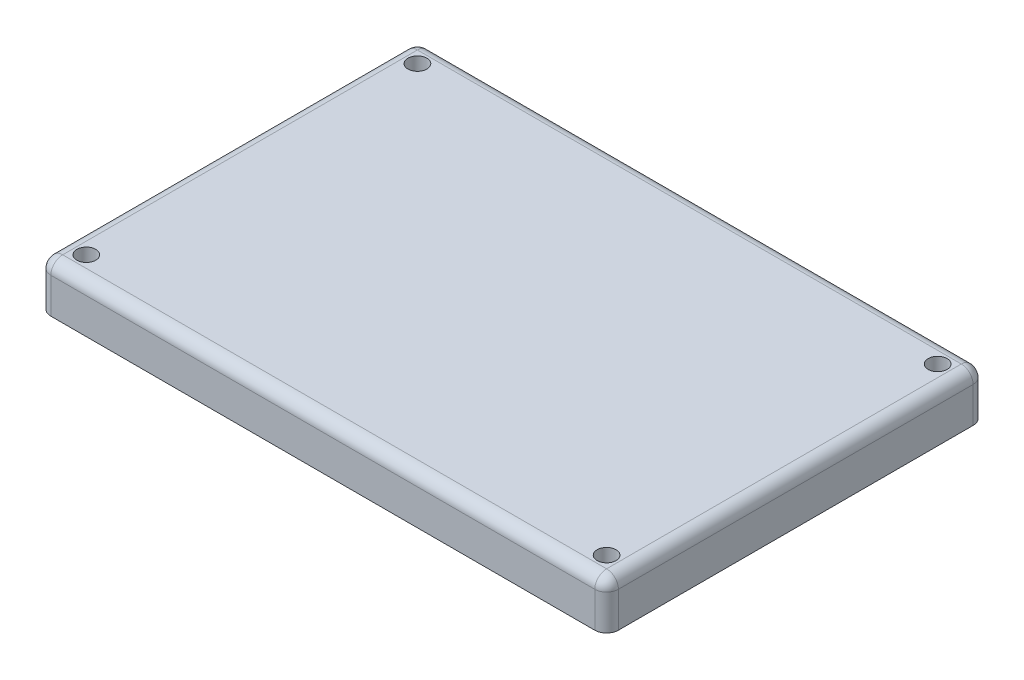
ISO-10303-21;
HEADER;
FILE_DESCRIPTION(('STEP AP214'),'2;1');
FILE_NAME('part.step','',(''),(''),'','','');
FILE_SCHEMA(('AUTOMOTIVE_DESIGN { 1 0 10303 214 1 1 1 1 }'));
ENDSEC;
DATA;
#1=APPLICATION_CONTEXT('core data for automotive mechanical design processes');
#2=APPLICATION_PROTOCOL_DEFINITION('international standard','automotive_design',2000,#1);
#3=PRODUCT_CONTEXT('',#1,'mechanical');
#4=PRODUCT('Part','Part','',(#3));
#5=PRODUCT_RELATED_PRODUCT_CATEGORY('part','',(#4));
#6=PRODUCT_DEFINITION_FORMATION('','',#4);
#7=PRODUCT_DEFINITION_CONTEXT('part definition',#1,'design');
#8=PRODUCT_DEFINITION('design','',#6,#7);
#9=PRODUCT_DEFINITION_SHAPE('','',#8);
#10=(LENGTH_UNIT() NAMED_UNIT(*) SI_UNIT(.MILLI.,.METRE.));
#11=(NAMED_UNIT(*) PLANE_ANGLE_UNIT() SI_UNIT($,.RADIAN.));
#12=(NAMED_UNIT(*) SI_UNIT($,.STERADIAN.) SOLID_ANGLE_UNIT());
#13=UNCERTAINTY_MEASURE_WITH_UNIT(LENGTH_MEASURE(1.E-05),#10,'distance_accuracy_value','');
#14=(GEOMETRIC_REPRESENTATION_CONTEXT(3) GLOBAL_UNCERTAINTY_ASSIGNED_CONTEXT((#13)) GLOBAL_UNIT_ASSIGNED_CONTEXT((#10,
#11,#12)) REPRESENTATION_CONTEXT('',''));
#15=CARTESIAN_POINT('',(0.,0.,0.));
#16=DIRECTION('',(0.,0.,1.));
#17=DIRECTION('',(1.,0.,0.));
#18=AXIS2_PLACEMENT_3D('',#15,#16,#17);
#19=CARTESIAN_POINT('',(0.,5.08,-40.64));
#20=DIRECTION('',(1.,0.,0.));
#21=DIRECTION('',(0.,0.,-1.));
#22=AXIS2_PLACEMENT_3D('',#19,#20,#21);
#23=PLANE('',#22);
#24=DIRECTION('',(0.,0.,1.));
#25=VECTOR('',#24,1.);
#26=CARTESIAN_POINT('',(0.,0.,-40.64));
#27=LINE('',#26,#25);
#28=CARTESIAN_POINT('',(0.,0.,-39.37));
#29=VERTEX_POINT('',#28);
#30=CARTESIAN_POINT('',(0.,0.,-1.27));
#31=VERTEX_POINT('',#30);
#32=EDGE_CURVE('E194',#29,#31,#27,.T.);
#33=ORIENTED_EDGE('',*,*,#32,.T.);
#34=DIRECTION('',(0.,-1.,0.));
#35=VECTOR('',#34,1.);
#36=CARTESIAN_POINT('',(0.,5.08,-1.27));
#37=LINE('',#36,#35);
#38=CARTESIAN_POINT('',(0.,3.81,-1.27));
#39=VERTEX_POINT('',#38);
#40=EDGE_CURVE('E11',#31,#39,#37,.F.);
#41=ORIENTED_EDGE('',*,*,#40,.T.);
#42=DIRECTION('',(0.,0.,1.));
#43=VECTOR('',#42,1.);
#44=CARTESIAN_POINT('',(0.,3.81,-40.64));
#45=LINE('',#44,#43);
#46=CARTESIAN_POINT('',(0.,3.81,-39.37));
#47=VERTEX_POINT('',#46);
#48=EDGE_CURVE('E48',#39,#47,#45,.F.);
#49=ORIENTED_EDGE('',*,*,#48,.T.);
#50=DIRECTION('',(0.,-1.,0.));
#51=VECTOR('',#50,1.);
#52=CARTESIAN_POINT('',(0.,5.08,-39.37));
#53=LINE('',#52,#51);
#54=EDGE_CURVE('E41',#47,#29,#53,.T.);
#55=ORIENTED_EDGE('',*,*,#54,.T.);
#56=EDGE_LOOP('',(#33,#41,#49,#55));
#57=FACE_BOUND('',#56,.T.);
#58=ADVANCED_FACE('F32',(#57),#23,.F.);
#59=CARTESIAN_POINT('',(0.,5.08,0.));
#60=DIRECTION('',(0.,0.,-1.));
#61=DIRECTION('',(-1.,0.,0.));
#62=AXIS2_PLACEMENT_3D('',#59,#60,#61);
#63=PLANE('',#62);
#64=DIRECTION('',(1.,0.,0.));
#65=VECTOR('',#64,1.);
#66=CARTESIAN_POINT('',(0.,0.,0.));
#67=LINE('',#66,#65);
#68=CARTESIAN_POINT('',(1.27,0.,0.));
#69=VERTEX_POINT('',#68);
#70=CARTESIAN_POINT('',(59.69,0.,0.));
#71=VERTEX_POINT('',#70);
#72=EDGE_CURVE('E196',#69,#71,#67,.T.);
#73=ORIENTED_EDGE('',*,*,#72,.T.);
#74=DIRECTION('',(0.,-1.,0.));
#75=VECTOR('',#74,1.);
#76=CARTESIAN_POINT('',(59.69,5.08,0.));
#77=LINE('',#76,#75);
#78=CARTESIAN_POINT('',(59.69,3.81,0.));
#79=VERTEX_POINT('',#78);
#80=EDGE_CURVE('E250',#71,#79,#77,.F.);
#81=ORIENTED_EDGE('',*,*,#80,.T.);
#82=DIRECTION('',(1.,0.,0.));
#83=VECTOR('',#82,1.);
#84=CARTESIAN_POINT('',(0.,3.81,0.));
#85=LINE('',#84,#83);
#86=CARTESIAN_POINT('',(1.27,3.81,0.));
#87=VERTEX_POINT('',#86);
#88=EDGE_CURVE('E248',#79,#87,#85,.F.);
#89=ORIENTED_EDGE('',*,*,#88,.T.);
#90=DIRECTION('',(0.,-1.,0.));
#91=VECTOR('',#90,1.);
#92=CARTESIAN_POINT('',(1.27,5.08,0.));
#93=LINE('',#92,#91);
#94=EDGE_CURVE('E246',#87,#69,#93,.T.);
#95=ORIENTED_EDGE('',*,*,#94,.T.);
#96=EDGE_LOOP('',(#73,#81,#89,#95));
#97=FACE_BOUND('',#96,.T.);
#98=ADVANCED_FACE('F377',(#97),#63,.F.);
#99=CARTESIAN_POINT('',(60.96,5.08,0.));
#100=DIRECTION('',(-1.,0.,0.));
#101=DIRECTION('',(0.,0.,1.));
#102=AXIS2_PLACEMENT_3D('',#99,#100,#101);
#103=PLANE('',#102);
#104=DIRECTION('',(0.,0.,-1.));
#105=VECTOR('',#104,1.);
#106=CARTESIAN_POINT('',(60.96,0.,0.));
#107=LINE('',#106,#105);
#108=CARTESIAN_POINT('',(60.96,0.,-1.27));
#109=VERTEX_POINT('',#108);
#110=CARTESIAN_POINT('',(60.96,0.,-39.37));
#111=VERTEX_POINT('',#110);
#112=EDGE_CURVE('E199',#109,#111,#107,.T.);
#113=ORIENTED_EDGE('',*,*,#112,.T.);
#114=DIRECTION('',(0.,-1.,0.));
#115=VECTOR('',#114,1.);
#116=CARTESIAN_POINT('',(60.96,5.08,-39.37));
#117=LINE('',#116,#115);
#118=CARTESIAN_POINT('',(60.96,3.81,-39.37));
#119=VERTEX_POINT('',#118);
#120=EDGE_CURVE('E235',#111,#119,#117,.F.);
#121=ORIENTED_EDGE('',*,*,#120,.T.);
#122=DIRECTION('',(0.,0.,-1.));
#123=VECTOR('',#122,1.);
#124=CARTESIAN_POINT('',(60.96,3.81,0.));
#125=LINE('',#124,#123);
#126=CARTESIAN_POINT('',(60.96,3.81,-1.27));
#127=VERTEX_POINT('',#126);
#128=EDGE_CURVE('E233',#119,#127,#125,.F.);
#129=ORIENTED_EDGE('',*,*,#128,.T.);
#130=DIRECTION('',(0.,-1.,0.));
#131=VECTOR('',#130,1.);
#132=CARTESIAN_POINT('',(60.96,5.08,-1.27));
#133=LINE('',#132,#131);
#134=EDGE_CURVE('E231',#127,#109,#133,.T.);
#135=ORIENTED_EDGE('',*,*,#134,.T.);
#136=EDGE_LOOP('',(#113,#121,#129,#135));
#137=FACE_BOUND('',#136,.T.);
#138=ADVANCED_FACE('F382',(#137),#103,.F.);
#139=CARTESIAN_POINT('',(60.96,5.08,-40.64));
#140=DIRECTION('',(0.,0.,1.));
#141=DIRECTION('',(1.,0.,0.));
#142=AXIS2_PLACEMENT_3D('',#139,#140,#141);
#143=PLANE('',#142);
#144=DIRECTION('',(-1.,0.,0.));
#145=VECTOR('',#144,1.);
#146=CARTESIAN_POINT('',(60.96,3.81,-40.64));
#147=LINE('',#146,#145);
#148=CARTESIAN_POINT('',(1.27,3.81,-40.64));
#149=VERTEX_POINT('',#148);
#150=CARTESIAN_POINT('',(59.69,3.81,-40.64));
#151=VERTEX_POINT('',#150);
#152=EDGE_CURVE('E216',#149,#151,#147,.F.);
#153=ORIENTED_EDGE('',*,*,#152,.T.);
#154=DIRECTION('',(0.,-1.,0.));
#155=VECTOR('',#154,1.);
#156=CARTESIAN_POINT('',(59.69,5.08,-40.64));
#157=LINE('',#156,#155);
#158=CARTESIAN_POINT('',(59.69,0.,-40.64));
#159=VERTEX_POINT('',#158);
#160=EDGE_CURVE('E220',#151,#159,#157,.T.);
#161=ORIENTED_EDGE('',*,*,#160,.T.);
#162=DIRECTION('',(-1.,0.,0.));
#163=VECTOR('',#162,1.);
#164=CARTESIAN_POINT('',(60.96,0.,-40.64));
#165=LINE('',#164,#163);
#166=CARTESIAN_POINT('',(1.26999999999999,0.,-40.64));
#167=VERTEX_POINT('',#166);
#168=EDGE_CURVE('E202',#159,#167,#165,.T.);
#169=ORIENTED_EDGE('',*,*,#168,.T.);
#170=DIRECTION('',(0.,-1.,0.));
#171=VECTOR('',#170,1.);
#172=CARTESIAN_POINT('',(1.26999999999999,5.08,-40.64));
#173=LINE('',#172,#171);
#174=EDGE_CURVE('E218',#167,#149,#173,.F.);
#175=ORIENTED_EDGE('',*,*,#174,.T.);
#176=EDGE_LOOP('',(#153,#161,#169,#175));
#177=FACE_BOUND('',#176,.T.);
#178=ADVANCED_FACE('F461',(#177),#143,.F.);
#179=CARTESIAN_POINT('',(0.,5.08,0.));
#180=DIRECTION('',(0.,1.,0.));
#181=DIRECTION('',(0.,0.,1.));
#182=AXIS2_PLACEMENT_3D('',#179,#180,#181);
#183=PLANE('',#182);
#184=DIRECTION('',(1.,0.,0.));
#185=VECTOR('',#184,1.);
#186=CARTESIAN_POINT('',(60.96,5.08,-1.27));
#187=LINE('',#186,#185);
#188=CARTESIAN_POINT('',(1.27,5.08,-1.27));
#189=VERTEX_POINT('',#188);
#190=CARTESIAN_POINT('',(59.69,5.08,-1.27));
#191=VERTEX_POINT('',#190);
#192=EDGE_CURVE('E241',#189,#191,#187,.T.);
#193=ORIENTED_EDGE('',*,*,#192,.T.);
#194=DIRECTION('',(0.,0.,-1.));
#195=VECTOR('',#194,1.);
#196=CARTESIAN_POINT('',(59.69,5.08,-40.64));
#197=LINE('',#196,#195);
#198=CARTESIAN_POINT('',(59.69,5.08,-39.37));
#199=VERTEX_POINT('',#198);
#200=EDGE_CURVE('E243',#191,#199,#197,.T.);
#201=ORIENTED_EDGE('',*,*,#200,.T.);
#202=DIRECTION('',(-1.,0.,0.));
#203=VECTOR('',#202,1.);
#204=CARTESIAN_POINT('',(0.,5.08,-39.37));
#205=LINE('',#204,#203);
#206=CARTESIAN_POINT('',(1.27,5.08,-39.37));
#207=VERTEX_POINT('',#206);
#208=EDGE_CURVE('E239',#199,#207,#205,.T.);
#209=ORIENTED_EDGE('',*,*,#208,.T.);
#210=DIRECTION('',(0.,0.,1.));
#211=VECTOR('',#210,1.);
#212=CARTESIAN_POINT('',(1.27,5.08,0.));
#213=LINE('',#212,#211);
#214=EDGE_CURVE('E237',#207,#189,#213,.T.);
#215=ORIENTED_EDGE('',*,*,#214,.T.);
#216=EDGE_LOOP('',(#193,#201,#209,#215));
#217=FACE_BOUND('',#216,.T.);
#218=CARTESIAN_POINT('',(2.54,5.08,-38.1));
#219=DIRECTION('',(0.,-1.,0.));
#220=DIRECTION('',(0.,0.,-1.));
#221=AXIS2_PLACEMENT_3D('',#218,#219,#220);
#222=CIRCLE('',#221,1.016);
#223=CARTESIAN_POINT('',(2.54,5.08,-39.116));
#224=VERTEX_POINT('',#223);
#225=EDGE_CURVE('E293',#224,#224,#222,.T.);
#226=ORIENTED_EDGE('',*,*,#225,.T.);
#227=EDGE_LOOP('',(#226));
#228=FACE_BOUND('',#227,.T.);
#229=CARTESIAN_POINT('',(2.54,5.08,-2.54));
#230=DIRECTION('',(0.,-1.,0.));
#231=DIRECTION('',(0.,0.,-1.));
#232=AXIS2_PLACEMENT_3D('',#229,#230,#231);
#233=CIRCLE('',#232,1.016);
#234=CARTESIAN_POINT('',(2.54,5.08,-3.556));
#235=VERTEX_POINT('',#234);
#236=EDGE_CURVE('E301',#235,#235,#233,.T.);
#237=ORIENTED_EDGE('',*,*,#236,.T.);
#238=EDGE_LOOP('',(#237));
#239=FACE_BOUND('',#238,.T.);
#240=CARTESIAN_POINT('',(58.42,5.08,-2.54));
#241=DIRECTION('',(0.,-1.,0.));
#242=DIRECTION('',(0.,0.,-1.));
#243=AXIS2_PLACEMENT_3D('',#240,#241,#242);
#244=CIRCLE('',#243,1.016);
#245=CARTESIAN_POINT('',(58.42,5.08,-3.556));
#246=VERTEX_POINT('',#245);
#247=EDGE_CURVE('E307',#246,#246,#244,.T.);
#248=ORIENTED_EDGE('',*,*,#247,.T.);
#249=EDGE_LOOP('',(#248));
#250=FACE_BOUND('',#249,.T.);
#251=CARTESIAN_POINT('',(58.42,5.08,-38.1));
#252=DIRECTION('',(0.,-1.,0.));
#253=DIRECTION('',(0.,0.,-1.));
#254=AXIS2_PLACEMENT_3D('',#251,#252,#253);
#255=CIRCLE('',#254,1.016);
#256=CARTESIAN_POINT('',(58.42,5.08,-39.116));
#257=VERTEX_POINT('',#256);
#258=EDGE_CURVE('E166',#257,#257,#255,.T.);
#259=ORIENTED_EDGE('',*,*,#258,.T.);
#260=EDGE_LOOP('',(#259));
#261=FACE_BOUND('',#260,.T.);
#262=ADVANCED_FACE('F456',(#217,#228,#239,#250,#261),#183,.T.);
#263=CARTESIAN_POINT('',(0.,0.,0.));
#264=DIRECTION('',(0.,1.,0.));
#265=DIRECTION('',(0.,0.,1.));
#266=AXIS2_PLACEMENT_3D('',#263,#264,#265);
#267=PLANE('',#266);
#268=CARTESIAN_POINT('',(2.54,0.,-38.1));
#269=DIRECTION('',(0.,-1.,0.));
#270=DIRECTION('',(0.,0.,-1.));
#271=AXIS2_PLACEMENT_3D('',#268,#269,#270);
#272=CIRCLE('',#271,1.016);
#273=CARTESIAN_POINT('',(2.54,0.,-39.116));
#274=VERTEX_POINT('',#273);
#275=EDGE_CURVE('E289',#274,#274,#272,.T.);
#276=ORIENTED_EDGE('',*,*,#275,.F.);
#277=EDGE_LOOP('',(#276));
#278=FACE_BOUND('',#277,.T.);
#279=CARTESIAN_POINT('',(2.54,0.,-2.54));
#280=DIRECTION('',(0.,-1.,0.));
#281=DIRECTION('',(0.,0.,-1.));
#282=AXIS2_PLACEMENT_3D('',#279,#280,#281);
#283=CIRCLE('',#282,1.016);
#284=CARTESIAN_POINT('',(2.54,0.,-3.556));
#285=VERTEX_POINT('',#284);
#286=EDGE_CURVE('E298',#285,#285,#283,.T.);
#287=ORIENTED_EDGE('',*,*,#286,.F.);
#288=EDGE_LOOP('',(#287));
#289=FACE_BOUND('',#288,.T.);
#290=CARTESIAN_POINT('',(58.42,0.,-2.54));
#291=DIRECTION('',(0.,-1.,0.));
#292=DIRECTION('',(0.,0.,-1.));
#293=AXIS2_PLACEMENT_3D('',#290,#291,#292);
#294=CIRCLE('',#293,1.016);
#295=CARTESIAN_POINT('',(58.42,0.,-3.556));
#296=VERTEX_POINT('',#295);
#297=EDGE_CURVE('E304',#296,#296,#294,.T.);
#298=ORIENTED_EDGE('',*,*,#297,.F.);
#299=EDGE_LOOP('',(#298));
#300=FACE_BOUND('',#299,.T.);
#301=CARTESIAN_POINT('',(58.42,0.,-38.1));
#302=DIRECTION('',(0.,-1.,0.));
#303=DIRECTION('',(0.,0.,-1.));
#304=AXIS2_PLACEMENT_3D('',#301,#302,#303);
#305=CIRCLE('',#304,1.016);
#306=CARTESIAN_POINT('',(58.42,0.,-39.116));
#307=VERTEX_POINT('',#306);
#308=EDGE_CURVE('E310',#307,#307,#305,.T.);
#309=ORIENTED_EDGE('',*,*,#308,.F.);
#310=EDGE_LOOP('',(#309));
#311=FACE_BOUND('',#310,.T.);
#312=ORIENTED_EDGE('',*,*,#168,.F.);
#313=CARTESIAN_POINT('',(59.69,0.,-39.37));
#314=DIRECTION('',(0.,1.,0.));
#315=DIRECTION('',(0.,0.,1.));
#316=AXIS2_PLACEMENT_3D('',#313,#314,#315);
#317=CIRCLE('',#316,1.27);
#318=EDGE_CURVE('E229',#159,#111,#317,.F.);
#319=ORIENTED_EDGE('',*,*,#318,.T.);
#320=ORIENTED_EDGE('',*,*,#112,.F.);
#321=CARTESIAN_POINT('',(59.69,0.,-1.27));
#322=DIRECTION('',(0.,1.,0.));
#323=DIRECTION('',(0.,0.,1.));
#324=AXIS2_PLACEMENT_3D('',#321,#322,#323);
#325=CIRCLE('',#324,1.27);
#326=EDGE_CURVE('E227',#109,#71,#325,.F.);
#327=ORIENTED_EDGE('',*,*,#326,.T.);
#328=ORIENTED_EDGE('',*,*,#72,.F.);
#329=CARTESIAN_POINT('',(1.27,0.,-1.27));
#330=DIRECTION('',(0.,1.,0.));
#331=DIRECTION('',(0.,0.,1.));
#332=AXIS2_PLACEMENT_3D('',#329,#330,#331);
#333=CIRCLE('',#332,1.27);
#334=EDGE_CURVE('E225',#69,#31,#333,.F.);
#335=ORIENTED_EDGE('',*,*,#334,.T.);
#336=ORIENTED_EDGE('',*,*,#32,.F.);
#337=CARTESIAN_POINT('',(1.27,0.,-39.37));
#338=DIRECTION('',(0.,1.,0.));
#339=DIRECTION('',(0.,0.,1.));
#340=AXIS2_PLACEMENT_3D('',#337,#338,#339);
#341=CIRCLE('',#340,1.27);
#342=EDGE_CURVE('E223',#29,#167,#341,.F.);
#343=ORIENTED_EDGE('',*,*,#342,.T.);
#344=EDGE_LOOP('',(#312,#319,#320,#327,#328,#335,#336,#343));
#345=FACE_BOUND('',#344,.T.);
#346=DIRECTION('',(-1.,0.,0.));
#347=VECTOR('',#346,1.);
#348=CARTESIAN_POINT('',(60.96,0.,-38.1));
#349=LINE('',#348,#347);
#350=CARTESIAN_POINT('',(55.88,0.,-38.1));
#351=VERTEX_POINT('',#350);
#352=CARTESIAN_POINT('',(5.08,0.,-38.1));
#353=VERTEX_POINT('',#352);
#354=EDGE_CURVE('E173',#351,#353,#349,.T.);
#355=ORIENTED_EDGE('',*,*,#354,.T.);
#356=CARTESIAN_POINT('',(2.54,0.,-38.1));
#357=DIRECTION('',(0.,-1.,0.));
#358=DIRECTION('',(0.,0.,-1.));
#359=AXIS2_PLACEMENT_3D('',#356,#357,#358);
#360=CIRCLE('',#359,2.54);
#361=CARTESIAN_POINT('',(2.54,0.,-35.56));
#362=VERTEX_POINT('',#361);
#363=EDGE_CURVE('E156',#353,#362,#360,.T.);
#364=ORIENTED_EDGE('',*,*,#363,.T.);
#365=DIRECTION('',(0.,0.,1.));
#366=VECTOR('',#365,1.);
#367=CARTESIAN_POINT('',(2.54,0.,-40.64));
#368=LINE('',#367,#366);
#369=CARTESIAN_POINT('',(2.54,0.,-5.08));
#370=VERTEX_POINT('',#369);
#371=EDGE_CURVE('E189',#362,#370,#368,.T.);
#372=ORIENTED_EDGE('',*,*,#371,.T.);
#373=CARTESIAN_POINT('',(2.54,0.,-2.54));
#374=DIRECTION('',(0.,-1.,0.));
#375=DIRECTION('',(0.,0.,-1.));
#376=AXIS2_PLACEMENT_3D('',#373,#374,#375);
#377=CIRCLE('',#376,2.54);
#378=CARTESIAN_POINT('',(5.08,0.,-2.54));
#379=VERTEX_POINT('',#378);
#380=EDGE_CURVE('E325',#370,#379,#377,.T.);
#381=ORIENTED_EDGE('',*,*,#380,.T.);
#382=DIRECTION('',(1.,0.,0.));
#383=VECTOR('',#382,1.);
#384=CARTESIAN_POINT('',(0.,0.,-2.54));
#385=LINE('',#384,#383);
#386=CARTESIAN_POINT('',(55.88,0.,-2.54));
#387=VERTEX_POINT('',#386);
#388=EDGE_CURVE('E186',#379,#387,#385,.T.);
#389=ORIENTED_EDGE('',*,*,#388,.T.);
#390=CARTESIAN_POINT('',(58.42,0.,-2.54));
#391=DIRECTION('',(0.,-1.,0.));
#392=DIRECTION('',(0.,0.,-1.));
#393=AXIS2_PLACEMENT_3D('',#390,#391,#392);
#394=CIRCLE('',#393,2.54);
#395=CARTESIAN_POINT('',(58.42,0.,-5.08));
#396=VERTEX_POINT('',#395);
#397=EDGE_CURVE('E318',#387,#396,#394,.T.);
#398=ORIENTED_EDGE('',*,*,#397,.T.);
#399=DIRECTION('',(0.,0.,-1.));
#400=VECTOR('',#399,1.);
#401=CARTESIAN_POINT('',(58.42,0.,0.));
#402=LINE('',#401,#400);
#403=CARTESIAN_POINT('',(58.42,0.,-35.56));
#404=VERTEX_POINT('',#403);
#405=EDGE_CURVE('E182',#396,#404,#402,.T.);
#406=ORIENTED_EDGE('',*,*,#405,.T.);
#407=CARTESIAN_POINT('',(58.42,0.,-38.1));
#408=DIRECTION('',(0.,-1.,0.));
#409=DIRECTION('',(0.,0.,-1.));
#410=AXIS2_PLACEMENT_3D('',#407,#408,#409);
#411=CIRCLE('',#410,2.54);
#412=EDGE_CURVE('E180',#404,#351,#411,.T.);
#413=ORIENTED_EDGE('',*,*,#412,.T.);
#414=EDGE_LOOP('',(#355,#364,#372,#381,#389,#398,#406,#413));
#415=FACE_BOUND('',#414,.T.);
#416=ADVANCED_FACE('F178',(#278,#289,#300,#311,#345,#415),#267,.F.);
#417=CARTESIAN_POINT('',(2.54,5.08,-40.64));
#418=DIRECTION('',(1.,0.,0.));
#419=DIRECTION('',(0.,0.,-1.));
#420=AXIS2_PLACEMENT_3D('',#417,#418,#419);
#421=PLANE('',#420);
#422=DIRECTION('',(0.,-1.,0.));
#423=VECTOR('',#422,1.);
#424=CARTESIAN_POINT('',(2.54,5.08,-35.56));
#425=LINE('',#424,#423);
#426=CARTESIAN_POINT('',(2.54,2.54,-35.56));
#427=VERTEX_POINT('',#426);
#428=EDGE_CURVE('E162',#427,#362,#425,.T.);
#429=ORIENTED_EDGE('',*,*,#428,.F.);
#430=DIRECTION('',(0.,0.,1.));
#431=VECTOR('',#430,1.);
#432=CARTESIAN_POINT('',(2.54,2.54,-40.64));
#433=LINE('',#432,#431);
#434=CARTESIAN_POINT('',(2.54,2.54,-5.08));
#435=VERTEX_POINT('',#434);
#436=EDGE_CURVE('E181',#427,#435,#433,.T.);
#437=ORIENTED_EDGE('',*,*,#436,.T.);
#438=DIRECTION('',(0.,-1.,0.));
#439=VECTOR('',#438,1.);
#440=CARTESIAN_POINT('',(2.54,5.08,-5.08));
#441=LINE('',#440,#439);
#442=EDGE_CURVE('E330',#370,#435,#441,.F.);
#443=ORIENTED_EDGE('',*,*,#442,.F.);
#444=ORIENTED_EDGE('',*,*,#371,.F.);
#445=EDGE_LOOP('',(#429,#437,#443,#444));
#446=FACE_BOUND('',#445,.T.);
#447=ADVANCED_FACE('F354',(#446),#421,.T.);
#448=CARTESIAN_POINT('',(0.,5.08,-2.54));
#449=DIRECTION('',(0.,0.,-1.));
#450=DIRECTION('',(-1.,0.,0.));
#451=AXIS2_PLACEMENT_3D('',#448,#449,#450);
#452=PLANE('',#451);
#453=DIRECTION('',(0.,-1.,0.));
#454=VECTOR('',#453,1.);
#455=CARTESIAN_POINT('',(55.88,5.08,-2.54));
#456=LINE('',#455,#454);
#457=CARTESIAN_POINT('',(55.88,2.54,-2.54));
#458=VERTEX_POINT('',#457);
#459=EDGE_CURVE('E323',#387,#458,#456,.F.);
#460=ORIENTED_EDGE('',*,*,#459,.F.);
#461=ORIENTED_EDGE('',*,*,#388,.F.);
#462=DIRECTION('',(0.,-1.,0.));
#463=VECTOR('',#462,1.);
#464=CARTESIAN_POINT('',(5.08,5.08,-2.54));
#465=LINE('',#464,#463);
#466=CARTESIAN_POINT('',(5.08,2.54,-2.54));
#467=VERTEX_POINT('',#466);
#468=EDGE_CURVE('E328',#467,#379,#465,.T.);
#469=ORIENTED_EDGE('',*,*,#468,.F.);
#470=DIRECTION('',(1.,0.,0.));
#471=VECTOR('',#470,1.);
#472=CARTESIAN_POINT('',(0.,2.54,-2.54));
#473=LINE('',#472,#471);
#474=EDGE_CURVE('E184',#467,#458,#473,.T.);
#475=ORIENTED_EDGE('',*,*,#474,.T.);
#476=EDGE_LOOP('',(#460,#461,#469,#475));
#477=FACE_BOUND('',#476,.T.);
#478=ADVANCED_FACE('F364',(#477),#452,.T.);
#479=CARTESIAN_POINT('',(58.42,5.08,0.));
#480=DIRECTION('',(-1.,0.,0.));
#481=DIRECTION('',(0.,0.,1.));
#482=AXIS2_PLACEMENT_3D('',#479,#480,#481);
#483=PLANE('',#482);
#484=DIRECTION('',(0.,-1.,0.));
#485=VECTOR('',#484,1.);
#486=CARTESIAN_POINT('',(58.42,5.08,-5.08));
#487=LINE('',#486,#485);
#488=CARTESIAN_POINT('',(58.42,2.54,-5.08));
#489=VERTEX_POINT('',#488);
#490=EDGE_CURVE('E321',#489,#396,#487,.T.);
#491=ORIENTED_EDGE('',*,*,#490,.F.);
#492=DIRECTION('',(0.,0.,-1.));
#493=VECTOR('',#492,1.);
#494=CARTESIAN_POINT('',(58.42,2.54,0.));
#495=LINE('',#494,#493);
#496=CARTESIAN_POINT('',(58.42,2.54,-35.56));
#497=VERTEX_POINT('',#496);
#498=EDGE_CURVE('E341',#489,#497,#495,.T.);
#499=ORIENTED_EDGE('',*,*,#498,.T.);
#500=DIRECTION('',(0.,-1.,0.));
#501=VECTOR('',#500,1.);
#502=CARTESIAN_POINT('',(58.42,5.08,-35.56));
#503=LINE('',#502,#501);
#504=EDGE_CURVE('E336',#404,#497,#503,.F.);
#505=ORIENTED_EDGE('',*,*,#504,.F.);
#506=ORIENTED_EDGE('',*,*,#405,.F.);
#507=EDGE_LOOP('',(#491,#499,#505,#506));
#508=FACE_BOUND('',#507,.T.);
#509=ADVANCED_FACE('F346',(#508),#483,.T.);
#510=CARTESIAN_POINT('',(60.96,5.08,-38.1));
#511=DIRECTION('',(0.,0.,1.));
#512=DIRECTION('',(1.,0.,0.));
#513=AXIS2_PLACEMENT_3D('',#510,#511,#512);
#514=PLANE('',#513);
#515=DIRECTION('',(0.,-1.,0.));
#516=VECTOR('',#515,1.);
#517=CARTESIAN_POINT('',(5.08,5.08,-38.1));
#518=LINE('',#517,#516);
#519=CARTESIAN_POINT('',(5.08,2.54,-38.1));
#520=VERTEX_POINT('',#519);
#521=EDGE_CURVE('E159',#353,#520,#518,.F.);
#522=ORIENTED_EDGE('',*,*,#521,.F.);
#523=ORIENTED_EDGE('',*,*,#354,.F.);
#524=DIRECTION('',(0.,-1.,0.));
#525=VECTOR('',#524,1.);
#526=CARTESIAN_POINT('',(55.88,5.08,-38.1));
#527=LINE('',#526,#525);
#528=CARTESIAN_POINT('',(55.88,2.54,-38.1));
#529=VERTEX_POINT('',#528);
#530=EDGE_CURVE('E334',#529,#351,#527,.T.);
#531=ORIENTED_EDGE('',*,*,#530,.F.);
#532=DIRECTION('',(-1.,0.,0.));
#533=VECTOR('',#532,1.);
#534=CARTESIAN_POINT('',(60.96,2.54,-38.1));
#535=LINE('',#534,#533);
#536=EDGE_CURVE('E175',#529,#520,#535,.T.);
#537=ORIENTED_EDGE('',*,*,#536,.T.);
#538=EDGE_LOOP('',(#522,#523,#531,#537));
#539=FACE_BOUND('',#538,.T.);
#540=ADVANCED_FACE('F171',(#539),#514,.T.);
#541=CARTESIAN_POINT('',(0.,2.54,0.));
#542=DIRECTION('',(0.,1.,0.));
#543=DIRECTION('',(0.,0.,1.));
#544=AXIS2_PLACEMENT_3D('',#541,#542,#543);
#545=PLANE('',#544);
#546=ORIENTED_EDGE('',*,*,#436,.F.);
#547=CARTESIAN_POINT('',(2.54,2.54,-38.1));
#548=DIRECTION('',(0.,1.,0.));
#549=DIRECTION('',(0.,0.,1.));
#550=AXIS2_PLACEMENT_3D('',#547,#548,#549);
#551=CIRCLE('',#550,2.54);
#552=EDGE_CURVE('E214',#427,#520,#551,.T.);
#553=ORIENTED_EDGE('',*,*,#552,.T.);
#554=ORIENTED_EDGE('',*,*,#536,.F.);
#555=CARTESIAN_POINT('',(58.42,2.54,-38.1));
#556=DIRECTION('',(0.,1.,0.));
#557=DIRECTION('',(0.,0.,1.));
#558=AXIS2_PLACEMENT_3D('',#555,#556,#557);
#559=CIRCLE('',#558,2.54);
#560=EDGE_CURVE('E205',#529,#497,#559,.T.);
#561=ORIENTED_EDGE('',*,*,#560,.T.);
#562=ORIENTED_EDGE('',*,*,#498,.F.);
#563=CARTESIAN_POINT('',(58.42,2.54,-2.54));
#564=DIRECTION('',(0.,1.,0.));
#565=DIRECTION('',(0.,0.,1.));
#566=AXIS2_PLACEMENT_3D('',#563,#564,#565);
#567=CIRCLE('',#566,2.54);
#568=EDGE_CURVE('E211',#489,#458,#567,.T.);
#569=ORIENTED_EDGE('',*,*,#568,.T.);
#570=ORIENTED_EDGE('',*,*,#474,.F.);
#571=CARTESIAN_POINT('',(2.54,2.54,-2.54));
#572=DIRECTION('',(0.,1.,0.));
#573=DIRECTION('',(0.,0.,1.));
#574=AXIS2_PLACEMENT_3D('',#571,#572,#573);
#575=CIRCLE('',#574,2.54);
#576=EDGE_CURVE('E208',#467,#435,#575,.T.);
#577=ORIENTED_EDGE('',*,*,#576,.T.);
#578=EDGE_LOOP('',(#546,#553,#554,#561,#562,#569,#570,#577));
#579=FACE_BOUND('',#578,.T.);
#580=ADVANCED_FACE('F352',(#579),#545,.F.);
#581=CARTESIAN_POINT('',(58.42,5.08,-38.1));
#582=DIRECTION('',(0.,-1.,0.));
#583=DIRECTION('',(0.,0.,-1.));
#584=AXIS2_PLACEMENT_3D('',#581,#582,#583);
#585=CYLINDRICAL_SURFACE('',#584,2.54);
#586=ORIENTED_EDGE('',*,*,#412,.F.);
#587=ORIENTED_EDGE('',*,*,#504,.T.);
#588=ORIENTED_EDGE('',*,*,#560,.F.);
#589=ORIENTED_EDGE('',*,*,#530,.T.);
#590=EDGE_LOOP('',(#586,#587,#588,#589));
#591=FACE_BOUND('',#590,.T.);
#592=ADVANCED_FACE('F350',(#591),#585,.T.);
#593=CARTESIAN_POINT('',(2.54,5.08,-2.54));
#594=DIRECTION('',(0.,-1.,0.));
#595=DIRECTION('',(0.,0.,-1.));
#596=AXIS2_PLACEMENT_3D('',#593,#594,#595);
#597=CYLINDRICAL_SURFACE('',#596,2.54);
#598=ORIENTED_EDGE('',*,*,#380,.F.);
#599=ORIENTED_EDGE('',*,*,#442,.T.);
#600=ORIENTED_EDGE('',*,*,#576,.F.);
#601=ORIENTED_EDGE('',*,*,#468,.T.);
#602=EDGE_LOOP('',(#598,#599,#600,#601));
#603=FACE_BOUND('',#602,.T.);
#604=ADVANCED_FACE('F359',(#603),#597,.T.);
#605=CARTESIAN_POINT('',(58.42,5.08,-2.54));
#606=DIRECTION('',(0.,-1.,0.));
#607=DIRECTION('',(0.,0.,-1.));
#608=AXIS2_PLACEMENT_3D('',#605,#606,#607);
#609=CYLINDRICAL_SURFACE('',#608,2.54);
#610=ORIENTED_EDGE('',*,*,#397,.F.);
#611=ORIENTED_EDGE('',*,*,#459,.T.);
#612=ORIENTED_EDGE('',*,*,#568,.F.);
#613=ORIENTED_EDGE('',*,*,#490,.T.);
#614=EDGE_LOOP('',(#610,#611,#612,#613));
#615=FACE_BOUND('',#614,.T.);
#616=ADVANCED_FACE('F366',(#615),#609,.T.);
#617=CARTESIAN_POINT('',(2.54,5.08,-38.1));
#618=DIRECTION('',(0.,-1.,0.));
#619=DIRECTION('',(0.,0.,-1.));
#620=AXIS2_PLACEMENT_3D('',#617,#618,#619);
#621=CYLINDRICAL_SURFACE('',#620,2.54);
#622=ORIENTED_EDGE('',*,*,#552,.F.);
#623=ORIENTED_EDGE('',*,*,#428,.T.);
#624=ORIENTED_EDGE('',*,*,#363,.F.);
#625=ORIENTED_EDGE('',*,*,#521,.T.);
#626=EDGE_LOOP('',(#622,#623,#624,#625));
#627=FACE_BOUND('',#626,.T.);
#628=ADVANCED_FACE('F158',(#627),#621,.T.);
#629=CARTESIAN_POINT('',(58.42,5.08,-38.1));
#630=DIRECTION('',(0.,-1.,0.));
#631=DIRECTION('',(0.,0.,-1.));
#632=AXIS2_PLACEMENT_3D('',#629,#630,#631);
#633=CYLINDRICAL_SURFACE('',#632,1.016);
#634=ORIENTED_EDGE('',*,*,#258,.F.);
#635=EDGE_LOOP('',(#634));
#636=FACE_BOUND('',#635,.T.);
#637=ORIENTED_EDGE('',*,*,#308,.T.);
#638=EDGE_LOOP('',(#637));
#639=FACE_BOUND('',#638,.T.);
#640=ADVANCED_FACE('F373',(#636,#639),#633,.F.);
#641=CARTESIAN_POINT('',(58.42,5.08,-2.54));
#642=DIRECTION('',(0.,-1.,0.));
#643=DIRECTION('',(0.,0.,-1.));
#644=AXIS2_PLACEMENT_3D('',#641,#642,#643);
#645=CYLINDRICAL_SURFACE('',#644,1.016);
#646=ORIENTED_EDGE('',*,*,#247,.F.);
#647=EDGE_LOOP('',(#646));
#648=FACE_BOUND('',#647,.T.);
#649=ORIENTED_EDGE('',*,*,#297,.T.);
#650=EDGE_LOOP('',(#649));
#651=FACE_BOUND('',#650,.T.);
#652=ADVANCED_FACE('F515',(#648,#651),#645,.F.);
#653=CARTESIAN_POINT('',(2.54,5.08,-2.54));
#654=DIRECTION('',(0.,-1.,0.));
#655=DIRECTION('',(0.,0.,-1.));
#656=AXIS2_PLACEMENT_3D('',#653,#654,#655);
#657=CYLINDRICAL_SURFACE('',#656,1.016);
#658=ORIENTED_EDGE('',*,*,#236,.F.);
#659=EDGE_LOOP('',(#658));
#660=FACE_BOUND('',#659,.T.);
#661=ORIENTED_EDGE('',*,*,#286,.T.);
#662=EDGE_LOOP('',(#661));
#663=FACE_BOUND('',#662,.T.);
#664=ADVANCED_FACE('F525',(#660,#663),#657,.F.);
#665=CARTESIAN_POINT('',(2.54,5.08,-38.1));
#666=DIRECTION('',(0.,-1.,0.));
#667=DIRECTION('',(0.,0.,-1.));
#668=AXIS2_PLACEMENT_3D('',#665,#666,#667);
#669=CYLINDRICAL_SURFACE('',#668,1.016);
#670=ORIENTED_EDGE('',*,*,#225,.F.);
#671=EDGE_LOOP('',(#670));
#672=FACE_BOUND('',#671,.T.);
#673=ORIENTED_EDGE('',*,*,#275,.T.);
#674=EDGE_LOOP('',(#673));
#675=FACE_BOUND('',#674,.T.);
#676=ADVANCED_FACE('F430',(#672,#675),#669,.F.);
#677=CARTESIAN_POINT('',(1.27,5.08,-1.27));
#678=DIRECTION('',(0.,-1.,0.));
#679=DIRECTION('',(0.,0.,-1.));
#680=AXIS2_PLACEMENT_3D('',#677,#678,#679);
#681=CYLINDRICAL_SURFACE('',#680,1.27);
#682=CARTESIAN_POINT('',(1.27,3.81,-1.27));
#683=DIRECTION('',(0.,1.,0.));
#684=DIRECTION('',(0.,0.,1.));
#685=AXIS2_PLACEMENT_3D('',#682,#683,#684);
#686=CIRCLE('',#685,1.27);
#687=EDGE_CURVE('E36',#39,#87,#686,.T.);
#688=ORIENTED_EDGE('',*,*,#687,.F.);
#689=ORIENTED_EDGE('',*,*,#40,.F.);
#690=ORIENTED_EDGE('',*,*,#334,.F.);
#691=ORIENTED_EDGE('',*,*,#94,.F.);
#692=EDGE_LOOP('',(#688,#689,#690,#691));
#693=FACE_BOUND('',#692,.T.);
#694=ADVANCED_FACE('F34',(#693),#681,.T.);
#695=CARTESIAN_POINT('',(1.27,3.81,-1.27));
#696=DIRECTION('',(0.,0.,1.));
#697=DIRECTION('',(1.,0.,0.));
#698=AXIS2_PLACEMENT_3D('',#695,#696,#697);
#699=SPHERICAL_SURFACE('',#698,1.27);
#700=CARTESIAN_POINT('',(1.27,3.81,-1.27));
#701=DIRECTION('',(0.,0.,1.));
#702=DIRECTION('',(1.,0.,0.));
#703=AXIS2_PLACEMENT_3D('',#700,#701,#702);
#704=CIRCLE('',#703,1.27);
#705=EDGE_CURVE('E280',#39,#189,#704,.F.);
#706=ORIENTED_EDGE('',*,*,#705,.F.);
#707=ORIENTED_EDGE('',*,*,#687,.T.);
#708=CARTESIAN_POINT('',(1.27,3.81,-1.27));
#709=DIRECTION('',(-1.,0.,0.));
#710=DIRECTION('',(0.,0.,1.));
#711=AXIS2_PLACEMENT_3D('',#708,#709,#710);
#712=CIRCLE('',#711,1.27);
#713=EDGE_CURVE('E282',#189,#87,#712,.F.);
#714=ORIENTED_EDGE('',*,*,#713,.F.);
#715=EDGE_LOOP('',(#706,#707,#714));
#716=FACE_BOUND('',#715,.T.);
#717=ADVANCED_FACE('F424',(#716),#699,.T.);
#718=CARTESIAN_POINT('',(59.69,5.08,-1.27));
#719=DIRECTION('',(0.,-1.,0.));
#720=DIRECTION('',(0.,0.,-1.));
#721=AXIS2_PLACEMENT_3D('',#718,#719,#720);
#722=CYLINDRICAL_SURFACE('',#721,1.27);
#723=ORIENTED_EDGE('',*,*,#326,.F.);
#724=ORIENTED_EDGE('',*,*,#134,.F.);
#725=CARTESIAN_POINT('',(59.69,3.81,-1.27));
#726=DIRECTION('',(0.,1.,0.));
#727=DIRECTION('',(0.,0.,1.));
#728=AXIS2_PLACEMENT_3D('',#725,#726,#727);
#729=CIRCLE('',#728,1.27);
#730=EDGE_CURVE('E277',#79,#127,#729,.T.);
#731=ORIENTED_EDGE('',*,*,#730,.F.);
#732=ORIENTED_EDGE('',*,*,#80,.F.);
#733=EDGE_LOOP('',(#723,#724,#731,#732));
#734=FACE_BOUND('',#733,.T.);
#735=ADVANCED_FACE('F422',(#734),#722,.T.);
#736=CARTESIAN_POINT('',(0.,3.81,-1.27));
#737=DIRECTION('',(-1.,0.,0.));
#738=DIRECTION('',(0.,0.,1.));
#739=AXIS2_PLACEMENT_3D('',#736,#737,#738);
#740=CYLINDRICAL_SURFACE('',#739,1.27);
#741=ORIENTED_EDGE('',*,*,#713,.T.);
#742=ORIENTED_EDGE('',*,*,#88,.F.);
#743=CARTESIAN_POINT('',(59.69,3.81,-1.27));
#744=DIRECTION('',(1.,0.,0.));
#745=DIRECTION('',(0.,0.,-1.));
#746=AXIS2_PLACEMENT_3D('',#743,#744,#745);
#747=CIRCLE('',#746,1.27);
#748=EDGE_CURVE('E274',#191,#79,#747,.T.);
#749=ORIENTED_EDGE('',*,*,#748,.F.);
#750=ORIENTED_EDGE('',*,*,#192,.F.);
#751=EDGE_LOOP('',(#741,#742,#749,#750));
#752=FACE_BOUND('',#751,.T.);
#753=ADVANCED_FACE('F418',(#752),#740,.T.);
#754=CARTESIAN_POINT('',(1.27,3.81,0.));
#755=DIRECTION('',(0.,0.,-1.));
#756=DIRECTION('',(-1.,0.,0.));
#757=AXIS2_PLACEMENT_3D('',#754,#755,#756);
#758=CYLINDRICAL_SURFACE('',#757,1.27);
#759=ORIENTED_EDGE('',*,*,#705,.T.);
#760=ORIENTED_EDGE('',*,*,#214,.F.);
#761=CARTESIAN_POINT('',(1.27,3.81,-39.37));
#762=DIRECTION('',(0.,0.,-1.));
#763=DIRECTION('',(-1.,0.,0.));
#764=AXIS2_PLACEMENT_3D('',#761,#762,#763);
#765=CIRCLE('',#764,1.27);
#766=EDGE_CURVE('E271',#47,#207,#765,.T.);
#767=ORIENTED_EDGE('',*,*,#766,.F.);
#768=ORIENTED_EDGE('',*,*,#48,.F.);
#769=EDGE_LOOP('',(#759,#760,#767,#768));
#770=FACE_BOUND('',#769,.T.);
#771=ADVANCED_FACE('F414',(#770),#758,.T.);
#772=CARTESIAN_POINT('',(1.27,5.08,-39.37));
#773=DIRECTION('',(0.,-1.,0.));
#774=DIRECTION('',(0.,0.,-1.));
#775=AXIS2_PLACEMENT_3D('',#772,#773,#774);
#776=CYLINDRICAL_SURFACE('',#775,1.27);
#777=ORIENTED_EDGE('',*,*,#342,.F.);
#778=ORIENTED_EDGE('',*,*,#54,.F.);
#779=CARTESIAN_POINT('',(1.27,3.81,-39.37));
#780=DIRECTION('',(0.,1.,0.));
#781=DIRECTION('',(0.,0.,1.));
#782=AXIS2_PLACEMENT_3D('',#779,#780,#781);
#783=CIRCLE('',#782,1.27);
#784=EDGE_CURVE('E268',#149,#47,#783,.T.);
#785=ORIENTED_EDGE('',*,*,#784,.F.);
#786=ORIENTED_EDGE('',*,*,#174,.F.);
#787=EDGE_LOOP('',(#777,#778,#785,#786));
#788=FACE_BOUND('',#787,.T.);
#789=ADVANCED_FACE('F410',(#788),#776,.T.);
#790=CARTESIAN_POINT('',(59.69,3.81,-1.27));
#791=DIRECTION('',(0.,0.,1.));
#792=DIRECTION('',(1.,0.,0.));
#793=AXIS2_PLACEMENT_3D('',#790,#791,#792);
#794=SPHERICAL_SURFACE('',#793,1.27);
#795=ORIENTED_EDGE('',*,*,#748,.T.);
#796=ORIENTED_EDGE('',*,*,#730,.T.);
#797=CARTESIAN_POINT('',(59.69,3.81,-1.27));
#798=DIRECTION('',(0.,0.,1.));
#799=DIRECTION('',(1.,0.,0.));
#800=AXIS2_PLACEMENT_3D('',#797,#798,#799);
#801=CIRCLE('',#800,1.27);
#802=EDGE_CURVE('E265',#191,#127,#801,.F.);
#803=ORIENTED_EDGE('',*,*,#802,.F.);
#804=EDGE_LOOP('',(#795,#796,#803));
#805=FACE_BOUND('',#804,.T.);
#806=ADVANCED_FACE('F406',(#805),#794,.T.);
#807=CARTESIAN_POINT('',(1.27,3.81,-39.37));
#808=DIRECTION('',(0.,0.,1.));
#809=DIRECTION('',(1.,0.,0.));
#810=AXIS2_PLACEMENT_3D('',#807,#808,#809);
#811=SPHERICAL_SURFACE('',#810,1.27);
#812=ORIENTED_EDGE('',*,*,#784,.T.);
#813=ORIENTED_EDGE('',*,*,#766,.T.);
#814=CARTESIAN_POINT('',(1.27,3.81,-39.37));
#815=DIRECTION('',(-1.,0.,0.));
#816=DIRECTION('',(0.,0.,1.));
#817=AXIS2_PLACEMENT_3D('',#814,#815,#816);
#818=CIRCLE('',#817,1.27);
#819=EDGE_CURVE('E262',#149,#207,#818,.F.);
#820=ORIENTED_EDGE('',*,*,#819,.F.);
#821=EDGE_LOOP('',(#812,#813,#820));
#822=FACE_BOUND('',#821,.T.);
#823=ADVANCED_FACE('F402',(#822),#811,.T.);
#824=CARTESIAN_POINT('',(59.69,3.81,0.));
#825=DIRECTION('',(0.,0.,1.));
#826=DIRECTION('',(1.,0.,0.));
#827=AXIS2_PLACEMENT_3D('',#824,#825,#826);
#828=CYLINDRICAL_SURFACE('',#827,1.27);
#829=ORIENTED_EDGE('',*,*,#802,.T.);
#830=ORIENTED_EDGE('',*,*,#128,.F.);
#831=CARTESIAN_POINT('',(59.69,3.81,-39.37));
#832=DIRECTION('',(0.,0.,-1.));
#833=DIRECTION('',(-1.,0.,0.));
#834=AXIS2_PLACEMENT_3D('',#831,#832,#833);
#835=CIRCLE('',#834,1.27);
#836=EDGE_CURVE('E259',#199,#119,#835,.T.);
#837=ORIENTED_EDGE('',*,*,#836,.F.);
#838=ORIENTED_EDGE('',*,*,#200,.F.);
#839=EDGE_LOOP('',(#829,#830,#837,#838));
#840=FACE_BOUND('',#839,.T.);
#841=ADVANCED_FACE('F398',(#840),#828,.T.);
#842=CARTESIAN_POINT('',(0.,3.81,-39.37));
#843=DIRECTION('',(1.,0.,0.));
#844=DIRECTION('',(0.,0.,-1.));
#845=AXIS2_PLACEMENT_3D('',#842,#843,#844);
#846=CYLINDRICAL_SURFACE('',#845,1.27);
#847=ORIENTED_EDGE('',*,*,#819,.T.);
#848=ORIENTED_EDGE('',*,*,#208,.F.);
#849=CARTESIAN_POINT('',(59.69,3.81,-39.37));
#850=DIRECTION('',(1.,0.,0.));
#851=DIRECTION('',(0.,0.,-1.));
#852=AXIS2_PLACEMENT_3D('',#849,#850,#851);
#853=CIRCLE('',#852,1.27);
#854=EDGE_CURVE('E257',#151,#199,#853,.T.);
#855=ORIENTED_EDGE('',*,*,#854,.F.);
#856=ORIENTED_EDGE('',*,*,#152,.F.);
#857=EDGE_LOOP('',(#847,#848,#855,#856));
#858=FACE_BOUND('',#857,.T.);
#859=ADVANCED_FACE('F394',(#858),#846,.T.);
#860=CARTESIAN_POINT('',(59.69,3.81,-39.37));
#861=DIRECTION('',(0.,0.,1.));
#862=DIRECTION('',(1.,0.,0.));
#863=AXIS2_PLACEMENT_3D('',#860,#861,#862);
#864=SPHERICAL_SURFACE('',#863,1.27);
#865=ORIENTED_EDGE('',*,*,#854,.T.);
#866=ORIENTED_EDGE('',*,*,#836,.T.);
#867=CARTESIAN_POINT('',(59.69,3.81,-39.37));
#868=DIRECTION('',(0.,1.,0.));
#869=DIRECTION('',(0.,0.,1.));
#870=AXIS2_PLACEMENT_3D('',#867,#868,#869);
#871=CIRCLE('',#870,1.27);
#872=EDGE_CURVE('E254',#151,#119,#871,.F.);
#873=ORIENTED_EDGE('',*,*,#872,.F.);
#874=EDGE_LOOP('',(#865,#866,#873));
#875=FACE_BOUND('',#874,.T.);
#876=ADVANCED_FACE('F390',(#875),#864,.T.);
#877=CARTESIAN_POINT('',(59.69,5.08,-39.37));
#878=DIRECTION('',(0.,-1.,0.));
#879=DIRECTION('',(0.,0.,-1.));
#880=AXIS2_PLACEMENT_3D('',#877,#878,#879);
#881=CYLINDRICAL_SURFACE('',#880,1.27);
#882=ORIENTED_EDGE('',*,*,#872,.T.);
#883=ORIENTED_EDGE('',*,*,#120,.F.);
#884=ORIENTED_EDGE('',*,*,#318,.F.);
#885=ORIENTED_EDGE('',*,*,#160,.F.);
#886=EDGE_LOOP('',(#882,#883,#884,#885));
#887=FACE_BOUND('',#886,.T.);
#888=ADVANCED_FACE('F387',(#887),#881,.T.);
#889=CLOSED_SHELL('',(#58,#98,#138,#178,#262,#416,#447,#478,#509,#540,#580,#592,#604,#616,#628,
#640,#652,#664,#676,#694,#717,#735,#753,#771,#789,#806,#823,#841,#859,#876,#888));
#890=MANIFOLD_SOLID_BREP('B2',#889);
#891=ADVANCED_BREP_SHAPE_REPRESENTATION('',(#18,#890),#14);
#892=SHAPE_DEFINITION_REPRESENTATION(#9,#891);
ENDSEC;
END-ISO-10303-21;
